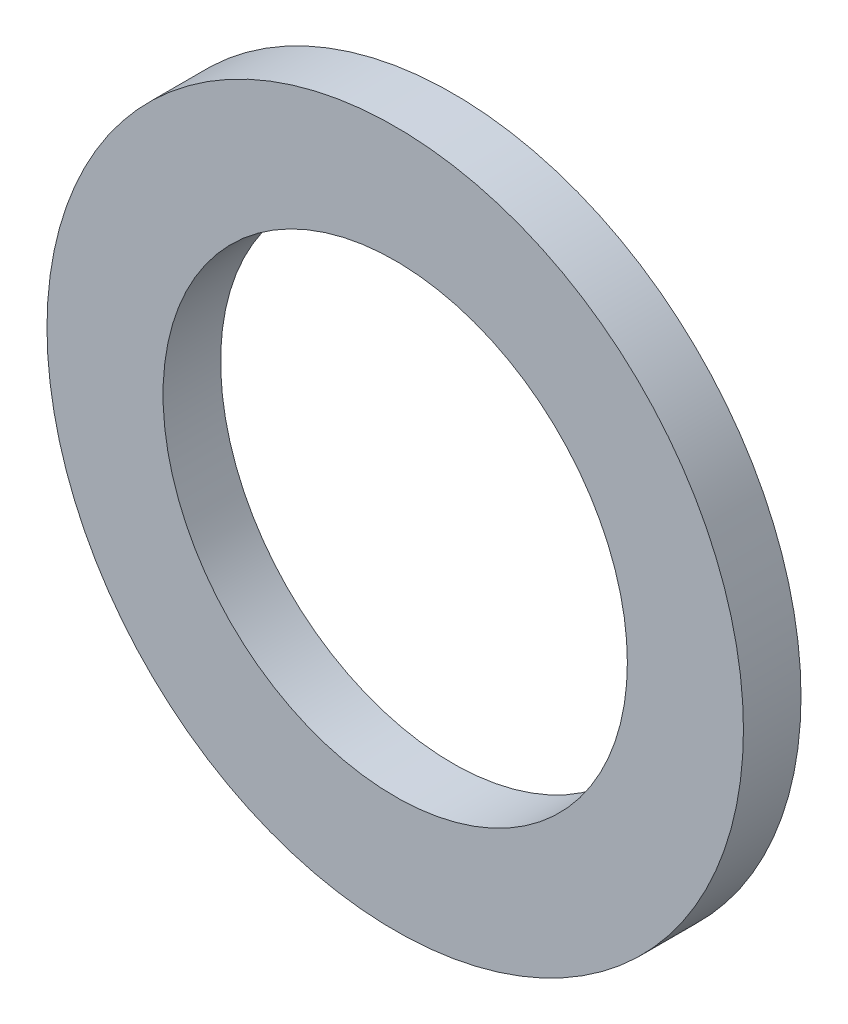
ISO-10303-21;
HEADER;
FILE_DESCRIPTION(('STEP AP214'),'2;1');
FILE_NAME('part.step','',(''),(''),'','','');
FILE_SCHEMA(('AUTOMOTIVE_DESIGN { 1 0 10303 214 1 1 1 1 }'));
ENDSEC;
DATA;
#1=APPLICATION_CONTEXT('core data for automotive mechanical design processes');
#2=APPLICATION_PROTOCOL_DEFINITION('international standard','automotive_design',2000,#1);
#3=PRODUCT_CONTEXT('',#1,'mechanical');
#4=PRODUCT('Part','Part','',(#3));
#5=PRODUCT_RELATED_PRODUCT_CATEGORY('part','',(#4));
#6=PRODUCT_DEFINITION_FORMATION('','',#4);
#7=PRODUCT_DEFINITION_CONTEXT('part definition',#1,'design');
#8=PRODUCT_DEFINITION('design','',#6,#7);
#9=PRODUCT_DEFINITION_SHAPE('','',#8);
#10=(LENGTH_UNIT() NAMED_UNIT(*) SI_UNIT(.MILLI.,.METRE.));
#11=(NAMED_UNIT(*) PLANE_ANGLE_UNIT() SI_UNIT($,.RADIAN.));
#12=(NAMED_UNIT(*) SI_UNIT($,.STERADIAN.) SOLID_ANGLE_UNIT());
#13=UNCERTAINTY_MEASURE_WITH_UNIT(LENGTH_MEASURE(1.E-05),#10,'distance_accuracy_value','');
#14=(GEOMETRIC_REPRESENTATION_CONTEXT(3) GLOBAL_UNCERTAINTY_ASSIGNED_CONTEXT((#13)) GLOBAL_UNIT_ASSIGNED_CONTEXT((#10,
#11,#12)) REPRESENTATION_CONTEXT('',''));
#15=CARTESIAN_POINT('',(0.,0.,0.));
#16=DIRECTION('',(0.,0.,1.));
#17=DIRECTION('',(1.,0.,0.));
#18=AXIS2_PLACEMENT_3D('',#15,#16,#17);
#19=CARTESIAN_POINT('',(0.,0.,0.7874));
#20=DIRECTION('',(0.,0.,1.));
#21=DIRECTION('',(1.,0.,0.));
#22=AXIS2_PLACEMENT_3D('',#19,#20,#21);
#23=PLANE('',#22);
#24=CARTESIAN_POINT('',(0.,0.,0.7874));
#25=DIRECTION('',(0.,0.,1.));
#26=DIRECTION('',(1.,0.,0.));
#27=AXIS2_PLACEMENT_3D('',#24,#25,#26);
#28=CIRCLE('',#27,4.7625);
#29=CARTESIAN_POINT('',(4.7625,0.,0.7874));
#30=VERTEX_POINT('',#29);
#31=EDGE_CURVE('E10',#30,#30,#28,.T.);
#32=ORIENTED_EDGE('',*,*,#31,.T.);
#33=EDGE_LOOP('',(#32));
#34=FACE_BOUND('',#33,.T.);
#35=CARTESIAN_POINT('',(0.,0.,0.7874));
#36=DIRECTION('',(0.,0.,1.));
#37=DIRECTION('',(1.,0.,0.));
#38=AXIS2_PLACEMENT_3D('',#35,#36,#37);
#39=CIRCLE('',#38,3.175);
#40=CARTESIAN_POINT('',(3.175,0.,0.7874));
#41=VERTEX_POINT('',#40);
#42=EDGE_CURVE('E40',#41,#41,#39,.T.);
#43=ORIENTED_EDGE('',*,*,#42,.F.);
#44=EDGE_LOOP('',(#43));
#45=FACE_BOUND('',#44,.T.);
#46=ADVANCED_FACE('F29',(#34,#45),#23,.T.);
#47=CARTESIAN_POINT('',(0.,0.,0.));
#48=DIRECTION('',(0.,0.,1.));
#49=DIRECTION('',(1.,0.,0.));
#50=AXIS2_PLACEMENT_3D('',#47,#48,#49);
#51=PLANE('',#50);
#52=CARTESIAN_POINT('',(0.,0.,0.));
#53=DIRECTION('',(0.,0.,1.));
#54=DIRECTION('',(1.,0.,0.));
#55=AXIS2_PLACEMENT_3D('',#52,#53,#54);
#56=CIRCLE('',#55,4.7625);
#57=CARTESIAN_POINT('',(4.7625,0.,0.));
#58=VERTEX_POINT('',#57);
#59=EDGE_CURVE('E33',#58,#58,#56,.T.);
#60=ORIENTED_EDGE('',*,*,#59,.F.);
#61=EDGE_LOOP('',(#60));
#62=FACE_BOUND('',#61,.T.);
#63=CARTESIAN_POINT('',(0.,0.,0.));
#64=DIRECTION('',(0.,0.,1.));
#65=DIRECTION('',(1.,0.,0.));
#66=AXIS2_PLACEMENT_3D('',#63,#64,#65);
#67=CIRCLE('',#66,3.175);
#68=CARTESIAN_POINT('',(3.175,0.,0.));
#69=VERTEX_POINT('',#68);
#70=EDGE_CURVE('E42',#69,#69,#67,.T.);
#71=ORIENTED_EDGE('',*,*,#70,.T.);
#72=EDGE_LOOP('',(#71));
#73=FACE_BOUND('',#72,.T.);
#74=ADVANCED_FACE('F52',(#62,#73),#51,.F.);
#75=CARTESIAN_POINT('',(0.,0.,0.7874));
#76=DIRECTION('',(0.,0.,-1.));
#77=DIRECTION('',(-1.,0.,0.));
#78=AXIS2_PLACEMENT_3D('',#75,#76,#77);
#79=CYLINDRICAL_SURFACE('',#78,4.7625);
#80=ORIENTED_EDGE('',*,*,#31,.F.);
#81=EDGE_LOOP('',(#80));
#82=FACE_BOUND('',#81,.T.);
#83=ORIENTED_EDGE('',*,*,#59,.T.);
#84=EDGE_LOOP('',(#83));
#85=FACE_BOUND('',#84,.T.);
#86=ADVANCED_FACE('F31',(#82,#85),#79,.T.);
#87=CARTESIAN_POINT('',(0.,0.,0.7874));
#88=DIRECTION('',(0.,0.,-1.));
#89=DIRECTION('',(-1.,0.,0.));
#90=AXIS2_PLACEMENT_3D('',#87,#88,#89);
#91=CYLINDRICAL_SURFACE('',#90,3.175);
#92=ORIENTED_EDGE('',*,*,#42,.T.);
#93=EDGE_LOOP('',(#92));
#94=FACE_BOUND('',#93,.T.);
#95=ORIENTED_EDGE('',*,*,#70,.F.);
#96=EDGE_LOOP('',(#95));
#97=FACE_BOUND('',#96,.T.);
#98=ADVANCED_FACE('F48',(#94,#97),#91,.F.);
#99=CLOSED_SHELL('',(#46,#74,#86,#98));
#100=MANIFOLD_SOLID_BREP('B2',#99);
#101=ADVANCED_BREP_SHAPE_REPRESENTATION('',(#18,#100),#14);
#102=SHAPE_DEFINITION_REPRESENTATION(#9,#101);
ENDSEC;
END-ISO-10303-21;
